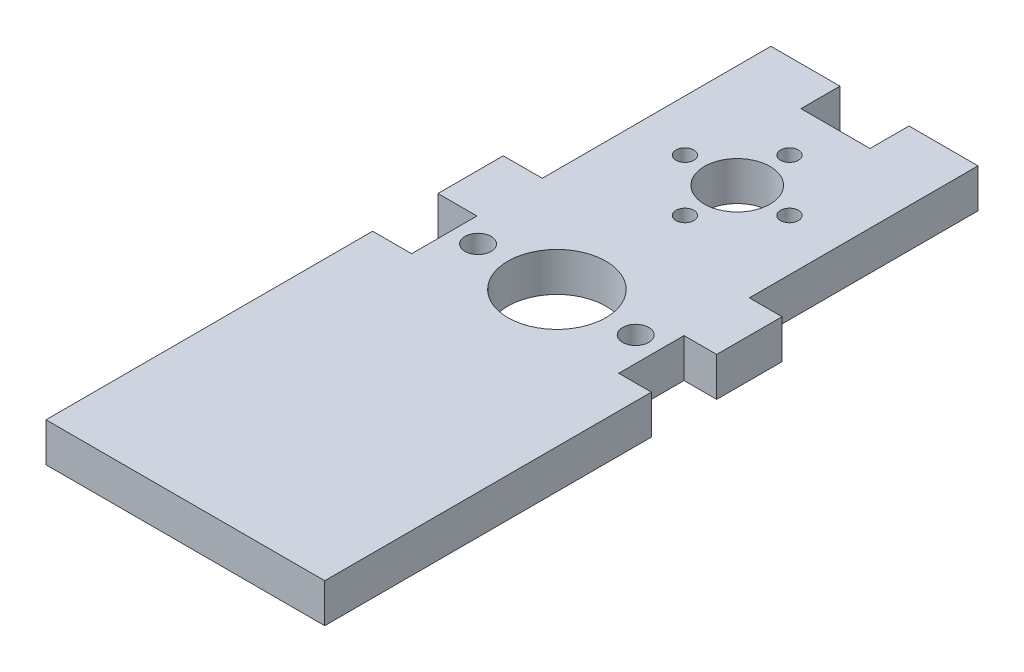
ISO-10303-21;
HEADER;
FILE_DESCRIPTION(('STEP AP214'),'2;1');
FILE_NAME('part.step','',(''),(''),'','','');
FILE_SCHEMA(('AUTOMOTIVE_DESIGN { 1 0 10303 214 1 1 1 1 }'));
ENDSEC;
DATA;
#1=APPLICATION_CONTEXT('core data for automotive mechanical design processes');
#2=APPLICATION_PROTOCOL_DEFINITION('international standard','automotive_design',2000,#1);
#3=PRODUCT_CONTEXT('',#1,'mechanical');
#4=PRODUCT('Part','Part','',(#3));
#5=PRODUCT_RELATED_PRODUCT_CATEGORY('part','',(#4));
#6=PRODUCT_DEFINITION_FORMATION('','',#4);
#7=PRODUCT_DEFINITION_CONTEXT('part definition',#1,'design');
#8=PRODUCT_DEFINITION('design','',#6,#7);
#9=PRODUCT_DEFINITION_SHAPE('','',#8);
#10=(LENGTH_UNIT() NAMED_UNIT(*) SI_UNIT(.MILLI.,.METRE.));
#11=(NAMED_UNIT(*) PLANE_ANGLE_UNIT() SI_UNIT($,.RADIAN.));
#12=(NAMED_UNIT(*) SI_UNIT($,.STERADIAN.) SOLID_ANGLE_UNIT());
#13=UNCERTAINTY_MEASURE_WITH_UNIT(LENGTH_MEASURE(1.E-05),#10,'distance_accuracy_value','');
#14=(GEOMETRIC_REPRESENTATION_CONTEXT(3) GLOBAL_UNCERTAINTY_ASSIGNED_CONTEXT((#13)) GLOBAL_UNIT_ASSIGNED_CONTEXT((#10,
#11,#12)) REPRESENTATION_CONTEXT('',''));
#15=CARTESIAN_POINT('',(0.,0.,0.));
#16=DIRECTION('',(0.,0.,1.));
#17=DIRECTION('',(1.,0.,0.));
#18=AXIS2_PLACEMENT_3D('',#15,#16,#17);
#19=CARTESIAN_POINT('',(31.7,5.969,0.));
#20=DIRECTION('',(-1.,0.,0.));
#21=DIRECTION('',(0.,0.,1.));
#22=AXIS2_PLACEMENT_3D('',#19,#20,#21);
#23=PLANE('',#22);
#24=DIRECTION('',(0.,1.,0.));
#25=VECTOR('',#24,1.);
#26=CARTESIAN_POINT('',(31.7,0.,-30.));
#27=LINE('',#26,#25);
#28=CARTESIAN_POINT('',(31.7,0.,-30.));
#29=VERTEX_POINT('',#28);
#30=CARTESIAN_POINT('',(31.7,5.969,-30.));
#31=VERTEX_POINT('',#30);
#32=EDGE_CURVE('E224',#29,#31,#27,.T.);
#33=ORIENTED_EDGE('',*,*,#32,.F.);
#34=DIRECTION('',(0.,0.,-1.));
#35=VECTOR('',#34,1.);
#36=CARTESIAN_POINT('',(31.7,0.,0.));
#37=LINE('',#36,#35);
#38=CARTESIAN_POINT('',(31.7,0.,-65.));
#39=VERTEX_POINT('',#38);
#40=EDGE_CURVE('E342',#29,#39,#37,.T.);
#41=ORIENTED_EDGE('',*,*,#40,.T.);
#42=DIRECTION('',(0.,-1.,0.));
#43=VECTOR('',#42,1.);
#44=CARTESIAN_POINT('',(31.7,5.969,-65.));
#45=LINE('',#44,#43);
#46=CARTESIAN_POINT('',(31.7,5.969,-65.));
#47=VERTEX_POINT('',#46);
#48=EDGE_CURVE('E11',#47,#39,#45,.T.);
#49=ORIENTED_EDGE('',*,*,#48,.F.);
#50=DIRECTION('',(0.,0.,-1.));
#51=VECTOR('',#50,1.);
#52=CARTESIAN_POINT('',(31.7,5.969,0.));
#53=LINE('',#52,#51);
#54=EDGE_CURVE('E325',#31,#47,#53,.T.);
#55=ORIENTED_EDGE('',*,*,#54,.F.);
#56=EDGE_LOOP('',(#33,#41,#49,#55));
#57=FACE_BOUND('',#56,.T.);
#58=ADVANCED_FACE('F32',(#57),#23,.F.);
#59=CARTESIAN_POINT('',(0.,5.969,0.));
#60=DIRECTION('',(1.,0.,0.));
#61=DIRECTION('',(0.,0.,-1.));
#62=AXIS2_PLACEMENT_3D('',#59,#60,#61);
#63=PLANE('',#62);
#64=DIRECTION('',(0.,0.,1.));
#65=VECTOR('',#64,1.);
#66=CARTESIAN_POINT('',(0.,5.969,0.));
#67=LINE('',#66,#65);
#68=CARTESIAN_POINT('',(0.,5.969,-20.));
#69=VERTEX_POINT('',#68);
#70=CARTESIAN_POINT('',(0.,5.969,-10.));
#71=VERTEX_POINT('',#70);
#72=EDGE_CURVE('E326',#69,#71,#67,.T.);
#73=ORIENTED_EDGE('',*,*,#72,.F.);
#74=DIRECTION('',(0.,1.,0.));
#75=VECTOR('',#74,1.);
#76=CARTESIAN_POINT('',(0.,0.,-20.));
#77=LINE('',#76,#75);
#78=CARTESIAN_POINT('',(0.,0.,-20.));
#79=VERTEX_POINT('',#78);
#80=EDGE_CURVE('E249',#79,#69,#77,.T.);
#81=ORIENTED_EDGE('',*,*,#80,.F.);
#82=DIRECTION('',(0.,0.,1.));
#83=VECTOR('',#82,1.);
#84=CARTESIAN_POINT('',(0.,0.,0.));
#85=LINE('',#84,#83);
#86=CARTESIAN_POINT('',(0.,0.,-10.));
#87=VERTEX_POINT('',#86);
#88=EDGE_CURVE('E319',#79,#87,#85,.T.);
#89=ORIENTED_EDGE('',*,*,#88,.T.);
#90=DIRECTION('',(0.,1.,0.));
#91=VECTOR('',#90,1.);
#92=CARTESIAN_POINT('',(0.,0.,-10.));
#93=LINE('',#92,#91);
#94=EDGE_CURVE('E265',#87,#71,#93,.T.);
#95=ORIENTED_EDGE('',*,*,#94,.T.);
#96=EDGE_LOOP('',(#73,#81,#89,#95));
#97=FACE_BOUND('',#96,.T.);
#98=ADVANCED_FACE('F424',(#97),#63,.F.);
#99=CARTESIAN_POINT('',(0.,5.969,0.));
#100=DIRECTION('',(0.,-1.,0.));
#101=DIRECTION('',(0.,0.,-1.));
#102=AXIS2_PLACEMENT_3D('',#99,#100,#101);
#103=PLANE('',#102);
#104=CARTESIAN_POINT('',(0.,5.969,-65.));
#105=VERTEX_POINT('',#104);
#106=CARTESIAN_POINT('',(0.,5.969,-30.));
#107=VERTEX_POINT('',#106);
#108=EDGE_CURVE('E322',#105,#107,#67,.T.);
#109=ORIENTED_EDGE('',*,*,#108,.T.);
#110=DIRECTION('',(-1.,0.,0.));
#111=VECTOR('',#110,1.);
#112=CARTESIAN_POINT('',(0.,5.969,-30.));
#113=LINE('',#112,#111);
#114=CARTESIAN_POINT('',(-5.969,5.969,-30.));
#115=VERTEX_POINT('',#114);
#116=EDGE_CURVE('E226',#107,#115,#113,.T.);
#117=ORIENTED_EDGE('',*,*,#116,.T.);
#118=DIRECTION('',(0.,0.,1.));
#119=VECTOR('',#118,1.);
#120=CARTESIAN_POINT('',(-5.969,5.969,-20.));
#121=LINE('',#120,#119);
#122=CARTESIAN_POINT('',(-5.969,5.969,-20.));
#123=VERTEX_POINT('',#122);
#124=EDGE_CURVE('E245',#115,#123,#121,.T.);
#125=ORIENTED_EDGE('',*,*,#124,.T.);
#126=DIRECTION('',(1.,0.,0.));
#127=VECTOR('',#126,1.);
#128=CARTESIAN_POINT('',(0.,5.969,-20.));
#129=LINE('',#128,#127);
#130=EDGE_CURVE('E237',#123,#69,#129,.T.);
#131=ORIENTED_EDGE('',*,*,#130,.T.);
#132=ORIENTED_EDGE('',*,*,#72,.T.);
#133=DIRECTION('',(-1.,0.,0.));
#134=VECTOR('',#133,1.);
#135=CARTESIAN_POINT('',(0.,5.969,-10.));
#136=LINE('',#135,#134);
#137=CARTESIAN_POINT('',(-5.969,5.969,-10.));
#138=VERTEX_POINT('',#137);
#139=EDGE_CURVE('E252',#71,#138,#136,.T.);
#140=ORIENTED_EDGE('',*,*,#139,.T.);
#141=DIRECTION('',(0.,0.,1.));
#142=VECTOR('',#141,1.);
#143=CARTESIAN_POINT('',(-5.969,5.969,0.));
#144=LINE('',#143,#142);
#145=CARTESIAN_POINT('',(-5.96899999999999,5.969,40.));
#146=VERTEX_POINT('',#145);
#147=EDGE_CURVE('E263',#138,#146,#144,.T.);
#148=ORIENTED_EDGE('',*,*,#147,.T.);
#149=DIRECTION('',(1.,0.,0.));
#150=VECTOR('',#149,1.);
#151=CARTESIAN_POINT('',(-5.96899999999999,5.969,40.));
#152=LINE('',#151,#150);
#153=CARTESIAN_POINT('',(36.7,5.969,40.));
#154=VERTEX_POINT('',#153);
#155=EDGE_CURVE('E195',#146,#154,#152,.T.);
#156=ORIENTED_EDGE('',*,*,#155,.T.);
#157=DIRECTION('',(0.,0.,-1.));
#158=VECTOR('',#157,1.);
#159=CARTESIAN_POINT('',(36.7,5.969,0.));
#160=LINE('',#159,#158);
#161=CARTESIAN_POINT('',(36.7,5.969,-10.));
#162=VERTEX_POINT('',#161);
#163=EDGE_CURVE('E187',#154,#162,#160,.T.);
#164=ORIENTED_EDGE('',*,*,#163,.T.);
#165=DIRECTION('',(-1.,0.,0.));
#166=VECTOR('',#165,1.);
#167=CARTESIAN_POINT('',(31.7,5.969,-10.));
#168=LINE('',#167,#166);
#169=CARTESIAN_POINT('',(31.7,5.969,-10.));
#170=VERTEX_POINT('',#169);
#171=EDGE_CURVE('E47',#162,#170,#168,.T.);
#172=ORIENTED_EDGE('',*,*,#171,.T.);
#173=CARTESIAN_POINT('',(31.7,5.969,-20.));
#174=VERTEX_POINT('',#173);
#175=EDGE_CURVE('E52',#170,#174,#53,.T.);
#176=ORIENTED_EDGE('',*,*,#175,.T.);
#177=DIRECTION('',(1.,0.,0.));
#178=VECTOR('',#177,1.);
#179=CARTESIAN_POINT('',(31.7,5.969,-20.));
#180=LINE('',#179,#178);
#181=CARTESIAN_POINT('',(36.7,5.969,-20.));
#182=VERTEX_POINT('',#181);
#183=EDGE_CURVE('E206',#174,#182,#180,.T.);
#184=ORIENTED_EDGE('',*,*,#183,.T.);
#185=DIRECTION('',(0.,0.,-1.));
#186=VECTOR('',#185,1.);
#187=CARTESIAN_POINT('',(36.7,5.969,-20.));
#188=LINE('',#187,#186);
#189=CARTESIAN_POINT('',(36.7,5.969,-30.));
#190=VERTEX_POINT('',#189);
#191=EDGE_CURVE('E219',#182,#190,#188,.T.);
#192=ORIENTED_EDGE('',*,*,#191,.T.);
#193=DIRECTION('',(-1.,0.,0.));
#194=VECTOR('',#193,1.);
#195=CARTESIAN_POINT('',(31.7,5.969,-30.));
#196=LINE('',#195,#194);
#197=EDGE_CURVE('E212',#190,#31,#196,.T.);
#198=ORIENTED_EDGE('',*,*,#197,.T.);
#199=ORIENTED_EDGE('',*,*,#54,.T.);
#200=DIRECTION('',(-1.,0.,0.));
#201=VECTOR('',#200,1.);
#202=CARTESIAN_POINT('',(21.1333333333333,5.969,-65.));
#203=LINE('',#202,#201);
#204=CARTESIAN_POINT('',(21.1333333333333,5.969,-65.));
#205=VERTEX_POINT('',#204);
#206=EDGE_CURVE('E328',#47,#205,#203,.T.);
#207=ORIENTED_EDGE('',*,*,#206,.T.);
#208=DIRECTION('',(0.,0.,1.));
#209=VECTOR('',#208,1.);
#210=CARTESIAN_POINT('',(21.1333333333333,5.969,-65.));
#211=LINE('',#210,#209);
#212=CARTESIAN_POINT('',(21.1333333333333,5.969,-59.031));
#213=VERTEX_POINT('',#212);
#214=EDGE_CURVE('E330',#205,#213,#211,.T.);
#215=ORIENTED_EDGE('',*,*,#214,.T.);
#216=DIRECTION('',(-1.,0.,0.));
#217=VECTOR('',#216,1.);
#218=CARTESIAN_POINT('',(21.1333333333333,5.969,-59.031));
#219=LINE('',#218,#217);
#220=CARTESIAN_POINT('',(10.5666666666667,5.969,-59.031));
#221=VERTEX_POINT('',#220);
#222=EDGE_CURVE('E332',#213,#221,#219,.T.);
#223=ORIENTED_EDGE('',*,*,#222,.T.);
#224=DIRECTION('',(0.,0.,-1.));
#225=VECTOR('',#224,1.);
#226=CARTESIAN_POINT('',(10.5666666666667,5.969,-65.));
#227=LINE('',#226,#225);
#228=CARTESIAN_POINT('',(10.5666666666667,5.969,-65.));
#229=VERTEX_POINT('',#228);
#230=EDGE_CURVE('E334',#221,#229,#227,.T.);
#231=ORIENTED_EDGE('',*,*,#230,.T.);
#232=DIRECTION('',(-1.,0.,0.));
#233=VECTOR('',#232,1.);
#234=CARTESIAN_POINT('',(0.,5.969,-65.));
#235=LINE('',#234,#233);
#236=EDGE_CURVE('E336',#229,#105,#235,.T.);
#237=ORIENTED_EDGE('',*,*,#236,.T.);
#238=EDGE_LOOP('',(#109,#117,#125,#131,#132,#140,#148,#156,#164,#172,#176,#184,#192,#198,#199,
#207,#215,#223,#231,#237));
#239=FACE_BOUND('',#238,.T.);
#240=CARTESIAN_POINT('',(15.85,5.969,-43.99));
#241=DIRECTION('',(0.,1.,0.));
#242=DIRECTION('',(0.,0.,1.));
#243=AXIS2_PLACEMENT_3D('',#240,#241,#242);
#244=CIRCLE('',#243,5.015);
#245=CARTESIAN_POINT('',(15.85,5.969,-38.975));
#246=VERTEX_POINT('',#245);
#247=EDGE_CURVE('E316',#246,#246,#244,.T.);
#248=ORIENTED_EDGE('',*,*,#247,.F.);
#249=EDGE_LOOP('',(#248));
#250=FACE_BOUND('',#249,.T.);
#251=CARTESIAN_POINT('',(15.85,5.969,-16.3861));
#252=DIRECTION('',(0.,1.,0.));
#253=DIRECTION('',(0.,0.,1.));
#254=AXIS2_PLACEMENT_3D('',#251,#252,#253);
#255=CIRCLE('',#254,7.5);
#256=CARTESIAN_POINT('',(15.85,5.969,-8.8861));
#257=VERTEX_POINT('',#256);
#258=EDGE_CURVE('E310',#257,#257,#255,.T.);
#259=ORIENTED_EDGE('',*,*,#258,.F.);
#260=EDGE_LOOP('',(#259));
#261=FACE_BOUND('',#260,.T.);
#262=CARTESIAN_POINT('',(3.785,5.969,-16.3861));
#263=DIRECTION('',(0.,1.,0.));
#264=DIRECTION('',(0.,0.,1.));
#265=AXIS2_PLACEMENT_3D('',#262,#263,#264);
#266=CIRCLE('',#265,2.);
#267=CARTESIAN_POINT('',(3.785,5.969,-14.3861));
#268=VERTEX_POINT('',#267);
#269=EDGE_CURVE('E304',#268,#268,#266,.T.);
#270=ORIENTED_EDGE('',*,*,#269,.F.);
#271=EDGE_LOOP('',(#270));
#272=FACE_BOUND('',#271,.T.);
#273=CARTESIAN_POINT('',(27.915,5.969,-16.3861));
#274=DIRECTION('',(0.,1.,0.));
#275=DIRECTION('',(0.,0.,1.));
#276=AXIS2_PLACEMENT_3D('',#273,#274,#275);
#277=CIRCLE('',#276,2.);
#278=CARTESIAN_POINT('',(27.915,5.969,-14.3861));
#279=VERTEX_POINT('',#278);
#280=EDGE_CURVE('E298',#279,#279,#277,.T.);
#281=ORIENTED_EDGE('',*,*,#280,.F.);
#282=EDGE_LOOP('',(#281));
#283=FACE_BOUND('',#282,.T.);
#284=CARTESIAN_POINT('',(7.85,5.969,-43.99));
#285=DIRECTION('',(0.,1.,0.));
#286=DIRECTION('',(0.,0.,1.));
#287=AXIS2_PLACEMENT_3D('',#284,#285,#286);
#288=CIRCLE('',#287,1.37);
#289=CARTESIAN_POINT('',(7.85,5.969,-42.62));
#290=VERTEX_POINT('',#289);
#291=EDGE_CURVE('E292',#290,#290,#288,.T.);
#292=ORIENTED_EDGE('',*,*,#291,.F.);
#293=EDGE_LOOP('',(#292));
#294=FACE_BOUND('',#293,.T.);
#295=CARTESIAN_POINT('',(23.85,5.969,-43.99));
#296=DIRECTION('',(0.,1.,0.));
#297=DIRECTION('',(0.,0.,1.));
#298=AXIS2_PLACEMENT_3D('',#295,#296,#297);
#299=CIRCLE('',#298,1.37);
#300=CARTESIAN_POINT('',(23.85,5.969,-42.62));
#301=VERTEX_POINT('',#300);
#302=EDGE_CURVE('E286',#301,#301,#299,.T.);
#303=ORIENTED_EDGE('',*,*,#302,.F.);
#304=EDGE_LOOP('',(#303));
#305=FACE_BOUND('',#304,.T.);
#306=CARTESIAN_POINT('',(15.85,5.969,-35.99));
#307=DIRECTION('',(0.,1.,0.));
#308=DIRECTION('',(0.,0.,1.));
#309=AXIS2_PLACEMENT_3D('',#306,#307,#308);
#310=CIRCLE('',#309,1.37);
#311=CARTESIAN_POINT('',(15.85,5.969,-34.62));
#312=VERTEX_POINT('',#311);
#313=EDGE_CURVE('E280',#312,#312,#310,.T.);
#314=ORIENTED_EDGE('',*,*,#313,.F.);
#315=EDGE_LOOP('',(#314));
#316=FACE_BOUND('',#315,.T.);
#317=CARTESIAN_POINT('',(15.85,5.969,-51.99));
#318=DIRECTION('',(0.,1.,0.));
#319=DIRECTION('',(0.,0.,1.));
#320=AXIS2_PLACEMENT_3D('',#317,#318,#319);
#321=CIRCLE('',#320,1.37);
#322=CARTESIAN_POINT('',(15.85,5.969,-50.62));
#323=VERTEX_POINT('',#322);
#324=EDGE_CURVE('E274',#323,#323,#321,.T.);
#325=ORIENTED_EDGE('',*,*,#324,.F.);
#326=EDGE_LOOP('',(#325));
#327=FACE_BOUND('',#326,.T.);
#328=ADVANCED_FACE('F388',(#239,#250,#261,#272,#283,#294,#305,#316,#327),#103,.F.);
#329=CARTESIAN_POINT('',(0.,0.,0.));
#330=DIRECTION('',(0.,-1.,0.));
#331=DIRECTION('',(0.,0.,-1.));
#332=AXIS2_PLACEMENT_3D('',#329,#330,#331);
#333=PLANE('',#332);
#334=CARTESIAN_POINT('',(15.85,0.,-35.99));
#335=DIRECTION('',(0.,1.,0.));
#336=DIRECTION('',(0.,0.,1.));
#337=AXIS2_PLACEMENT_3D('',#334,#335,#336);
#338=CIRCLE('',#337,1.37);
#339=CARTESIAN_POINT('',(15.85,0.,-34.62));
#340=VERTEX_POINT('',#339);
#341=EDGE_CURVE('E277',#340,#340,#338,.T.);
#342=ORIENTED_EDGE('',*,*,#341,.T.);
#343=EDGE_LOOP('',(#342));
#344=FACE_BOUND('',#343,.T.);
#345=CARTESIAN_POINT('',(7.85,0.,-43.99));
#346=DIRECTION('',(0.,1.,0.));
#347=DIRECTION('',(0.,0.,1.));
#348=AXIS2_PLACEMENT_3D('',#345,#346,#347);
#349=CIRCLE('',#348,1.37);
#350=CARTESIAN_POINT('',(7.85,0.,-42.62));
#351=VERTEX_POINT('',#350);
#352=EDGE_CURVE('E289',#351,#351,#349,.T.);
#353=ORIENTED_EDGE('',*,*,#352,.T.);
#354=EDGE_LOOP('',(#353));
#355=FACE_BOUND('',#354,.T.);
#356=CARTESIAN_POINT('',(3.785,0.,-16.3861));
#357=DIRECTION('',(0.,1.,0.));
#358=DIRECTION('',(0.,0.,1.));
#359=AXIS2_PLACEMENT_3D('',#356,#357,#358);
#360=CIRCLE('',#359,2.);
#361=CARTESIAN_POINT('',(3.785,0.,-14.3861));
#362=VERTEX_POINT('',#361);
#363=EDGE_CURVE('E301',#362,#362,#360,.T.);
#364=ORIENTED_EDGE('',*,*,#363,.T.);
#365=EDGE_LOOP('',(#364));
#366=FACE_BOUND('',#365,.T.);
#367=CARTESIAN_POINT('',(15.85,0.,-43.99));
#368=DIRECTION('',(0.,1.,0.));
#369=DIRECTION('',(0.,0.,1.));
#370=AXIS2_PLACEMENT_3D('',#367,#368,#369);
#371=CIRCLE('',#370,5.015);
#372=CARTESIAN_POINT('',(15.85,0.,-38.975));
#373=VERTEX_POINT('',#372);
#374=EDGE_CURVE('E313',#373,#373,#371,.T.);
#375=ORIENTED_EDGE('',*,*,#374,.T.);
#376=EDGE_LOOP('',(#375));
#377=FACE_BOUND('',#376,.T.);
#378=CARTESIAN_POINT('',(0.,0.,-65.));
#379=VERTEX_POINT('',#378);
#380=CARTESIAN_POINT('',(0.,0.,-30.));
#381=VERTEX_POINT('',#380);
#382=EDGE_CURVE('E339',#379,#381,#85,.T.);
#383=ORIENTED_EDGE('',*,*,#382,.F.);
#384=DIRECTION('',(-1.,0.,0.));
#385=VECTOR('',#384,1.);
#386=CARTESIAN_POINT('',(0.,0.,-65.));
#387=LINE('',#386,#385);
#388=CARTESIAN_POINT('',(10.5666666666667,0.,-65.));
#389=VERTEX_POINT('',#388);
#390=EDGE_CURVE('E353',#389,#379,#387,.T.);
#391=ORIENTED_EDGE('',*,*,#390,.F.);
#392=DIRECTION('',(0.,0.,-1.));
#393=VECTOR('',#392,1.);
#394=CARTESIAN_POINT('',(10.5666666666667,0.,-65.));
#395=LINE('',#394,#393);
#396=CARTESIAN_POINT('',(10.5666666666667,0.,-59.031));
#397=VERTEX_POINT('',#396);
#398=EDGE_CURVE('E351',#397,#389,#395,.T.);
#399=ORIENTED_EDGE('',*,*,#398,.F.);
#400=DIRECTION('',(-1.,0.,0.));
#401=VECTOR('',#400,1.);
#402=CARTESIAN_POINT('',(21.1333333333333,0.,-59.031));
#403=LINE('',#402,#401);
#404=CARTESIAN_POINT('',(21.1333333333333,0.,-59.031));
#405=VERTEX_POINT('',#404);
#406=EDGE_CURVE('E349',#405,#397,#403,.T.);
#407=ORIENTED_EDGE('',*,*,#406,.F.);
#408=DIRECTION('',(0.,0.,1.));
#409=VECTOR('',#408,1.);
#410=CARTESIAN_POINT('',(21.1333333333333,0.,-65.));
#411=LINE('',#410,#409);
#412=CARTESIAN_POINT('',(21.1333333333333,0.,-65.));
#413=VERTEX_POINT('',#412);
#414=EDGE_CURVE('E347',#413,#405,#411,.T.);
#415=ORIENTED_EDGE('',*,*,#414,.F.);
#416=DIRECTION('',(-1.,0.,0.));
#417=VECTOR('',#416,1.);
#418=CARTESIAN_POINT('',(21.1333333333333,0.,-65.));
#419=LINE('',#418,#417);
#420=EDGE_CURVE('E345',#39,#413,#419,.T.);
#421=ORIENTED_EDGE('',*,*,#420,.F.);
#422=ORIENTED_EDGE('',*,*,#40,.F.);
#423=DIRECTION('',(-1.,0.,0.));
#424=VECTOR('',#423,1.);
#425=CARTESIAN_POINT('',(31.7,0.,-30.));
#426=LINE('',#425,#424);
#427=CARTESIAN_POINT('',(36.7,0.,-30.));
#428=VERTEX_POINT('',#427);
#429=EDGE_CURVE('E215',#428,#29,#426,.T.);
#430=ORIENTED_EDGE('',*,*,#429,.F.);
#431=DIRECTION('',(0.,0.,-1.));
#432=VECTOR('',#431,1.);
#433=CARTESIAN_POINT('',(36.7,0.,-20.));
#434=LINE('',#433,#432);
#435=CARTESIAN_POINT('',(36.7,0.,-20.));
#436=VERTEX_POINT('',#435);
#437=EDGE_CURVE('E211',#436,#428,#434,.T.);
#438=ORIENTED_EDGE('',*,*,#437,.F.);
#439=DIRECTION('',(1.,0.,0.));
#440=VECTOR('',#439,1.);
#441=CARTESIAN_POINT('',(31.7,0.,-20.));
#442=LINE('',#441,#440);
#443=CARTESIAN_POINT('',(31.7,0.,-20.));
#444=VERTEX_POINT('',#443);
#445=EDGE_CURVE('E208',#444,#436,#442,.T.);
#446=ORIENTED_EDGE('',*,*,#445,.F.);
#447=CARTESIAN_POINT('',(31.7,0.,-10.));
#448=VERTEX_POINT('',#447);
#449=EDGE_CURVE('E343',#448,#444,#37,.T.);
#450=ORIENTED_EDGE('',*,*,#449,.F.);
#451=DIRECTION('',(-1.,0.,0.));
#452=VECTOR('',#451,1.);
#453=CARTESIAN_POINT('',(31.7,0.,-10.));
#454=LINE('',#453,#452);
#455=CARTESIAN_POINT('',(36.7,0.,-10.));
#456=VERTEX_POINT('',#455);
#457=EDGE_CURVE('E181',#456,#448,#454,.T.);
#458=ORIENTED_EDGE('',*,*,#457,.F.);
#459=DIRECTION('',(0.,0.,-1.));
#460=VECTOR('',#459,1.);
#461=CARTESIAN_POINT('',(36.7,0.,0.));
#462=LINE('',#461,#460);
#463=CARTESIAN_POINT('',(36.7,0.,40.));
#464=VERTEX_POINT('',#463);
#465=EDGE_CURVE('E171',#464,#456,#462,.T.);
#466=ORIENTED_EDGE('',*,*,#465,.F.);
#467=DIRECTION('',(1.,0.,0.));
#468=VECTOR('',#467,1.);
#469=CARTESIAN_POINT('',(-5.96899999999999,0.,40.));
#470=LINE('',#469,#468);
#471=CARTESIAN_POINT('',(-5.96899999999999,0.,40.));
#472=VERTEX_POINT('',#471);
#473=EDGE_CURVE('E178',#472,#464,#470,.T.);
#474=ORIENTED_EDGE('',*,*,#473,.F.);
#475=DIRECTION('',(0.,0.,1.));
#476=VECTOR('',#475,1.);
#477=CARTESIAN_POINT('',(-5.969,0.,0.));
#478=LINE('',#477,#476);
#479=CARTESIAN_POINT('',(-5.969,0.,-10.));
#480=VERTEX_POINT('',#479);
#481=EDGE_CURVE('E262',#480,#472,#478,.T.);
#482=ORIENTED_EDGE('',*,*,#481,.F.);
#483=DIRECTION('',(-1.,0.,0.));
#484=VECTOR('',#483,1.);
#485=CARTESIAN_POINT('',(0.,0.,-10.));
#486=LINE('',#485,#484);
#487=EDGE_CURVE('E259',#87,#480,#486,.T.);
#488=ORIENTED_EDGE('',*,*,#487,.F.);
#489=ORIENTED_EDGE('',*,*,#88,.F.);
#490=DIRECTION('',(1.,0.,0.));
#491=VECTOR('',#490,1.);
#492=CARTESIAN_POINT('',(0.,0.,-20.));
#493=LINE('',#492,#491);
#494=CARTESIAN_POINT('',(-5.969,0.,-20.));
#495=VERTEX_POINT('',#494);
#496=EDGE_CURVE('E240',#495,#79,#493,.T.);
#497=ORIENTED_EDGE('',*,*,#496,.F.);
#498=DIRECTION('',(0.,0.,1.));
#499=VECTOR('',#498,1.);
#500=CARTESIAN_POINT('',(-5.969,0.,-20.));
#501=LINE('',#500,#499);
#502=CARTESIAN_POINT('',(-5.969,0.,-30.));
#503=VERTEX_POINT('',#502);
#504=EDGE_CURVE('E236',#503,#495,#501,.T.);
#505=ORIENTED_EDGE('',*,*,#504,.F.);
#506=DIRECTION('',(-1.,0.,0.));
#507=VECTOR('',#506,1.);
#508=CARTESIAN_POINT('',(0.,0.,-30.));
#509=LINE('',#508,#507);
#510=EDGE_CURVE('E233',#381,#503,#509,.T.);
#511=ORIENTED_EDGE('',*,*,#510,.F.);
#512=EDGE_LOOP('',(#383,#391,#399,#407,#415,#421,#422,#430,#438,#446,#450,#458,#466,#474,#482,
#488,#489,#497,#505,#511));
#513=FACE_BOUND('',#512,.T.);
#514=CARTESIAN_POINT('',(15.85,0.,-16.3861));
#515=DIRECTION('',(0.,1.,0.));
#516=DIRECTION('',(0.,0.,1.));
#517=AXIS2_PLACEMENT_3D('',#514,#515,#516);
#518=CIRCLE('',#517,7.5);
#519=CARTESIAN_POINT('',(15.85,0.,-8.8861));
#520=VERTEX_POINT('',#519);
#521=EDGE_CURVE('E307',#520,#520,#518,.T.);
#522=ORIENTED_EDGE('',*,*,#521,.T.);
#523=EDGE_LOOP('',(#522));
#524=FACE_BOUND('',#523,.T.);
#525=CARTESIAN_POINT('',(27.915,0.,-16.3861));
#526=DIRECTION('',(0.,1.,0.));
#527=DIRECTION('',(0.,0.,1.));
#528=AXIS2_PLACEMENT_3D('',#525,#526,#527);
#529=CIRCLE('',#528,2.);
#530=CARTESIAN_POINT('',(27.915,0.,-14.3861));
#531=VERTEX_POINT('',#530);
#532=EDGE_CURVE('E295',#531,#531,#529,.T.);
#533=ORIENTED_EDGE('',*,*,#532,.T.);
#534=EDGE_LOOP('',(#533));
#535=FACE_BOUND('',#534,.T.);
#536=CARTESIAN_POINT('',(23.85,0.,-43.99));
#537=DIRECTION('',(0.,1.,0.));
#538=DIRECTION('',(0.,0.,1.));
#539=AXIS2_PLACEMENT_3D('',#536,#537,#538);
#540=CIRCLE('',#539,1.37);
#541=CARTESIAN_POINT('',(23.85,0.,-42.62));
#542=VERTEX_POINT('',#541);
#543=EDGE_CURVE('E283',#542,#542,#540,.T.);
#544=ORIENTED_EDGE('',*,*,#543,.T.);
#545=EDGE_LOOP('',(#544));
#546=FACE_BOUND('',#545,.T.);
#547=CARTESIAN_POINT('',(15.85,0.,-51.99));
#548=DIRECTION('',(0.,1.,0.));
#549=DIRECTION('',(0.,0.,1.));
#550=AXIS2_PLACEMENT_3D('',#547,#548,#549);
#551=CIRCLE('',#550,1.37);
#552=CARTESIAN_POINT('',(15.85,0.,-50.62));
#553=VERTEX_POINT('',#552);
#554=EDGE_CURVE('E271',#553,#553,#551,.T.);
#555=ORIENTED_EDGE('',*,*,#554,.T.);
#556=EDGE_LOOP('',(#555));
#557=FACE_BOUND('',#556,.T.);
#558=ADVANCED_FACE('F174',(#344,#355,#366,#377,#513,#524,#535,#546,#557),#333,.T.);
#559=ORIENTED_EDGE('',*,*,#382,.T.);
#560=DIRECTION('',(0.,1.,0.));
#561=VECTOR('',#560,1.);
#562=CARTESIAN_POINT('',(0.,0.,-30.));
#563=LINE('',#562,#561);
#564=EDGE_CURVE('E242',#381,#107,#563,.T.);
#565=ORIENTED_EDGE('',*,*,#564,.T.);
#566=ORIENTED_EDGE('',*,*,#108,.F.);
#567=DIRECTION('',(0.,-1.,0.));
#568=VECTOR('',#567,1.);
#569=CARTESIAN_POINT('',(0.,5.969,-65.));
#570=LINE('',#569,#568);
#571=EDGE_CURVE('E338',#105,#379,#570,.T.);
#572=ORIENTED_EDGE('',*,*,#571,.T.);
#573=EDGE_LOOP('',(#559,#565,#566,#572));
#574=FACE_BOUND('',#573,.T.);
#575=ADVANCED_FACE('F34',(#574),#63,.F.);
#576=ORIENTED_EDGE('',*,*,#175,.F.);
#577=DIRECTION('',(0.,1.,0.));
#578=VECTOR('',#577,1.);
#579=CARTESIAN_POINT('',(31.7,0.,-10.));
#580=LINE('',#579,#578);
#581=EDGE_CURVE('E204',#448,#170,#580,.T.);
#582=ORIENTED_EDGE('',*,*,#581,.F.);
#583=ORIENTED_EDGE('',*,*,#449,.T.);
#584=DIRECTION('',(0.,1.,0.));
#585=VECTOR('',#584,1.);
#586=CARTESIAN_POINT('',(31.7,0.,-20.));
#587=LINE('',#586,#585);
#588=EDGE_CURVE('E217',#444,#174,#587,.T.);
#589=ORIENTED_EDGE('',*,*,#588,.T.);
#590=EDGE_LOOP('',(#576,#582,#583,#589));
#591=FACE_BOUND('',#590,.T.);
#592=ADVANCED_FACE('F410',(#591),#23,.F.);
#593=CARTESIAN_POINT('',(21.1333333333333,5.969,-65.));
#594=DIRECTION('',(0.,0.,1.));
#595=DIRECTION('',(1.,0.,0.));
#596=AXIS2_PLACEMENT_3D('',#593,#594,#595);
#597=PLANE('',#596);
#598=ORIENTED_EDGE('',*,*,#420,.T.);
#599=DIRECTION('',(0.,-1.,0.));
#600=VECTOR('',#599,1.);
#601=CARTESIAN_POINT('',(21.1333333333333,5.969,-65.));
#602=LINE('',#601,#600);
#603=EDGE_CURVE('E40',#205,#413,#602,.T.);
#604=ORIENTED_EDGE('',*,*,#603,.F.);
#605=ORIENTED_EDGE('',*,*,#206,.F.);
#606=ORIENTED_EDGE('',*,*,#48,.T.);
#607=EDGE_LOOP('',(#598,#604,#605,#606));
#608=FACE_BOUND('',#607,.T.);
#609=ADVANCED_FACE('F393',(#608),#597,.F.);
#610=CARTESIAN_POINT('',(21.1333333333333,5.969,-65.));
#611=DIRECTION('',(1.,0.,0.));
#612=DIRECTION('',(0.,0.,-1.));
#613=AXIS2_PLACEMENT_3D('',#610,#611,#612);
#614=PLANE('',#613);
#615=ORIENTED_EDGE('',*,*,#414,.T.);
#616=DIRECTION('',(0.,-1.,0.));
#617=VECTOR('',#616,1.);
#618=CARTESIAN_POINT('',(21.1333333333333,5.969,-59.031));
#619=LINE('',#618,#617);
#620=EDGE_CURVE('E363',#213,#405,#619,.T.);
#621=ORIENTED_EDGE('',*,*,#620,.F.);
#622=ORIENTED_EDGE('',*,*,#214,.F.);
#623=ORIENTED_EDGE('',*,*,#603,.T.);
#624=EDGE_LOOP('',(#615,#621,#622,#623));
#625=FACE_BOUND('',#624,.T.);
#626=ADVANCED_FACE('F370',(#625),#614,.F.);
#627=CARTESIAN_POINT('',(21.1333333333333,5.969,-59.031));
#628=DIRECTION('',(0.,0.,1.));
#629=DIRECTION('',(1.,0.,0.));
#630=AXIS2_PLACEMENT_3D('',#627,#628,#629);
#631=PLANE('',#630);
#632=ORIENTED_EDGE('',*,*,#406,.T.);
#633=DIRECTION('',(0.,-1.,0.));
#634=VECTOR('',#633,1.);
#635=CARTESIAN_POINT('',(10.5666666666667,5.969,-59.031));
#636=LINE('',#635,#634);
#637=EDGE_CURVE('E360',#221,#397,#636,.T.);
#638=ORIENTED_EDGE('',*,*,#637,.F.);
#639=ORIENTED_EDGE('',*,*,#222,.F.);
#640=ORIENTED_EDGE('',*,*,#620,.T.);
#641=EDGE_LOOP('',(#632,#638,#639,#640));
#642=FACE_BOUND('',#641,.T.);
#643=ADVANCED_FACE('F381',(#642),#631,.F.);
#644=CARTESIAN_POINT('',(10.5666666666667,5.969,-65.));
#645=DIRECTION('',(-1.,0.,0.));
#646=DIRECTION('',(0.,0.,1.));
#647=AXIS2_PLACEMENT_3D('',#644,#645,#646);
#648=PLANE('',#647);
#649=ORIENTED_EDGE('',*,*,#398,.T.);
#650=DIRECTION('',(0.,-1.,0.));
#651=VECTOR('',#650,1.);
#652=CARTESIAN_POINT('',(10.5666666666667,5.969,-65.));
#653=LINE('',#652,#651);
#654=EDGE_CURVE('E357',#229,#389,#653,.T.);
#655=ORIENTED_EDGE('',*,*,#654,.F.);
#656=ORIENTED_EDGE('',*,*,#230,.F.);
#657=ORIENTED_EDGE('',*,*,#637,.T.);
#658=EDGE_LOOP('',(#649,#655,#656,#657));
#659=FACE_BOUND('',#658,.T.);
#660=ADVANCED_FACE('F385',(#659),#648,.F.);
#661=CARTESIAN_POINT('',(0.,5.969,-65.));
#662=DIRECTION('',(0.,0.,1.));
#663=DIRECTION('',(1.,0.,0.));
#664=AXIS2_PLACEMENT_3D('',#661,#662,#663);
#665=PLANE('',#664);
#666=ORIENTED_EDGE('',*,*,#390,.T.);
#667=ORIENTED_EDGE('',*,*,#571,.F.);
#668=ORIENTED_EDGE('',*,*,#236,.F.);
#669=ORIENTED_EDGE('',*,*,#654,.T.);
#670=EDGE_LOOP('',(#666,#667,#668,#669));
#671=FACE_BOUND('',#670,.T.);
#672=ADVANCED_FACE('F440',(#671),#665,.F.);
#673=CARTESIAN_POINT('',(15.85,5.969,-43.99));
#674=DIRECTION('',(0.,-1.,0.));
#675=DIRECTION('',(0.,0.,-1.));
#676=AXIS2_PLACEMENT_3D('',#673,#674,#675);
#677=CYLINDRICAL_SURFACE('',#676,5.015);
#678=ORIENTED_EDGE('',*,*,#247,.T.);
#679=EDGE_LOOP('',(#678));
#680=FACE_BOUND('',#679,.T.);
#681=ORIENTED_EDGE('',*,*,#374,.F.);
#682=EDGE_LOOP('',(#681));
#683=FACE_BOUND('',#682,.T.);
#684=ADVANCED_FACE('F442',(#680,#683),#677,.F.);
#685=CARTESIAN_POINT('',(15.85,5.969,-16.3861));
#686=DIRECTION('',(0.,-1.,0.));
#687=DIRECTION('',(0.,0.,-1.));
#688=AXIS2_PLACEMENT_3D('',#685,#686,#687);
#689=CYLINDRICAL_SURFACE('',#688,7.5);
#690=ORIENTED_EDGE('',*,*,#258,.T.);
#691=EDGE_LOOP('',(#690));
#692=FACE_BOUND('',#691,.T.);
#693=ORIENTED_EDGE('',*,*,#521,.F.);
#694=EDGE_LOOP('',(#693));
#695=FACE_BOUND('',#694,.T.);
#696=ADVANCED_FACE('F448',(#692,#695),#689,.F.);
#697=CARTESIAN_POINT('',(3.785,5.969,-16.3861));
#698=DIRECTION('',(0.,-1.,0.));
#699=DIRECTION('',(0.,0.,-1.));
#700=AXIS2_PLACEMENT_3D('',#697,#698,#699);
#701=CYLINDRICAL_SURFACE('',#700,2.);
#702=ORIENTED_EDGE('',*,*,#269,.T.);
#703=EDGE_LOOP('',(#702));
#704=FACE_BOUND('',#703,.T.);
#705=ORIENTED_EDGE('',*,*,#363,.F.);
#706=EDGE_LOOP('',(#705));
#707=FACE_BOUND('',#706,.T.);
#708=ADVANCED_FACE('F475',(#704,#707),#701,.F.);
#709=CARTESIAN_POINT('',(27.915,5.969,-16.3861));
#710=DIRECTION('',(0.,-1.,0.));
#711=DIRECTION('',(0.,0.,-1.));
#712=AXIS2_PLACEMENT_3D('',#709,#710,#711);
#713=CYLINDRICAL_SURFACE('',#712,2.);
#714=ORIENTED_EDGE('',*,*,#280,.T.);
#715=EDGE_LOOP('',(#714));
#716=FACE_BOUND('',#715,.T.);
#717=ORIENTED_EDGE('',*,*,#532,.F.);
#718=EDGE_LOOP('',(#717));
#719=FACE_BOUND('',#718,.T.);
#720=ADVANCED_FACE('F479',(#716,#719),#713,.F.);
#721=CARTESIAN_POINT('',(7.85,5.969,-43.99));
#722=DIRECTION('',(0.,-1.,0.));
#723=DIRECTION('',(0.,0.,-1.));
#724=AXIS2_PLACEMENT_3D('',#721,#722,#723);
#725=CYLINDRICAL_SURFACE('',#724,1.37);
#726=ORIENTED_EDGE('',*,*,#291,.T.);
#727=EDGE_LOOP('',(#726));
#728=FACE_BOUND('',#727,.T.);
#729=ORIENTED_EDGE('',*,*,#352,.F.);
#730=EDGE_LOOP('',(#729));
#731=FACE_BOUND('',#730,.T.);
#732=ADVANCED_FACE('F483',(#728,#731),#725,.F.);
#733=CARTESIAN_POINT('',(23.85,5.969,-43.99));
#734=DIRECTION('',(0.,-1.,0.));
#735=DIRECTION('',(0.,0.,-1.));
#736=AXIS2_PLACEMENT_3D('',#733,#734,#735);
#737=CYLINDRICAL_SURFACE('',#736,1.37);
#738=ORIENTED_EDGE('',*,*,#302,.T.);
#739=EDGE_LOOP('',(#738));
#740=FACE_BOUND('',#739,.T.);
#741=ORIENTED_EDGE('',*,*,#543,.F.);
#742=EDGE_LOOP('',(#741));
#743=FACE_BOUND('',#742,.T.);
#744=ADVANCED_FACE('F487',(#740,#743),#737,.F.);
#745=CARTESIAN_POINT('',(15.85,5.969,-35.99));
#746=DIRECTION('',(0.,-1.,0.));
#747=DIRECTION('',(0.,0.,-1.));
#748=AXIS2_PLACEMENT_3D('',#745,#746,#747);
#749=CYLINDRICAL_SURFACE('',#748,1.37);
#750=ORIENTED_EDGE('',*,*,#313,.T.);
#751=EDGE_LOOP('',(#750));
#752=FACE_BOUND('',#751,.T.);
#753=ORIENTED_EDGE('',*,*,#341,.F.);
#754=EDGE_LOOP('',(#753));
#755=FACE_BOUND('',#754,.T.);
#756=ADVANCED_FACE('F491',(#752,#755),#749,.F.);
#757=CARTESIAN_POINT('',(15.85,5.969,-51.99));
#758=DIRECTION('',(0.,-1.,0.));
#759=DIRECTION('',(0.,0.,-1.));
#760=AXIS2_PLACEMENT_3D('',#757,#758,#759);
#761=CYLINDRICAL_SURFACE('',#760,1.37);
#762=ORIENTED_EDGE('',*,*,#324,.T.);
#763=EDGE_LOOP('',(#762));
#764=FACE_BOUND('',#763,.T.);
#765=ORIENTED_EDGE('',*,*,#554,.F.);
#766=EDGE_LOOP('',(#765));
#767=FACE_BOUND('',#766,.T.);
#768=ADVANCED_FACE('F495',(#764,#767),#761,.F.);
#769=CARTESIAN_POINT('',(-5.969,0.,0.));
#770=DIRECTION('',(-1.,0.,0.));
#771=DIRECTION('',(0.,0.,1.));
#772=AXIS2_PLACEMENT_3D('',#769,#770,#771);
#773=PLANE('',#772);
#774=ORIENTED_EDGE('',*,*,#147,.F.);
#775=DIRECTION('',(0.,1.,0.));
#776=VECTOR('',#775,1.);
#777=CARTESIAN_POINT('',(-5.969,0.,-10.));
#778=LINE('',#777,#776);
#779=EDGE_CURVE('E269',#480,#138,#778,.T.);
#780=ORIENTED_EDGE('',*,*,#779,.F.);
#781=ORIENTED_EDGE('',*,*,#481,.T.);
#782=DIRECTION('',(0.,1.,0.));
#783=VECTOR('',#782,1.);
#784=CARTESIAN_POINT('',(-5.96899999999999,-58.4862681404789,40.));
#785=LINE('',#784,#783);
#786=EDGE_CURVE('E191',#472,#146,#785,.T.);
#787=ORIENTED_EDGE('',*,*,#786,.T.);
#788=EDGE_LOOP('',(#774,#780,#781,#787));
#789=FACE_BOUND('',#788,.T.);
#790=ADVANCED_FACE('F416',(#789),#773,.T.);
#791=CARTESIAN_POINT('',(0.,0.,-10.));
#792=DIRECTION('',(0.,0.,-1.));
#793=DIRECTION('',(-1.,0.,0.));
#794=AXIS2_PLACEMENT_3D('',#791,#792,#793);
#795=PLANE('',#794);
#796=ORIENTED_EDGE('',*,*,#139,.F.);
#797=ORIENTED_EDGE('',*,*,#94,.F.);
#798=ORIENTED_EDGE('',*,*,#487,.T.);
#799=ORIENTED_EDGE('',*,*,#779,.T.);
#800=EDGE_LOOP('',(#796,#797,#798,#799));
#801=FACE_BOUND('',#800,.T.);
#802=ADVANCED_FACE('F421',(#801),#795,.T.);
#803=CARTESIAN_POINT('',(0.,0.,-20.));
#804=DIRECTION('',(0.,0.,1.));
#805=DIRECTION('',(1.,0.,0.));
#806=AXIS2_PLACEMENT_3D('',#803,#804,#805);
#807=PLANE('',#806);
#808=ORIENTED_EDGE('',*,*,#130,.F.);
#809=DIRECTION('',(0.,1.,0.));
#810=VECTOR('',#809,1.);
#811=CARTESIAN_POINT('',(-5.969,0.,-20.));
#812=LINE('',#811,#810);
#813=EDGE_CURVE('E253',#495,#123,#812,.T.);
#814=ORIENTED_EDGE('',*,*,#813,.F.);
#815=ORIENTED_EDGE('',*,*,#496,.T.);
#816=ORIENTED_EDGE('',*,*,#80,.T.);
#817=EDGE_LOOP('',(#808,#814,#815,#816));
#818=FACE_BOUND('',#817,.T.);
#819=ADVANCED_FACE('F431',(#818),#807,.T.);
#820=CARTESIAN_POINT('',(-5.969,0.,-20.));
#821=DIRECTION('',(-1.,0.,0.));
#822=DIRECTION('',(0.,0.,1.));
#823=AXIS2_PLACEMENT_3D('',#820,#821,#822);
#824=PLANE('',#823);
#825=ORIENTED_EDGE('',*,*,#124,.F.);
#826=DIRECTION('',(0.,1.,0.));
#827=VECTOR('',#826,1.);
#828=CARTESIAN_POINT('',(-5.969,0.,-30.));
#829=LINE('',#828,#827);
#830=EDGE_CURVE('E255',#503,#115,#829,.T.);
#831=ORIENTED_EDGE('',*,*,#830,.F.);
#832=ORIENTED_EDGE('',*,*,#504,.T.);
#833=ORIENTED_EDGE('',*,*,#813,.T.);
#834=EDGE_LOOP('',(#825,#831,#832,#833));
#835=FACE_BOUND('',#834,.T.);
#836=ADVANCED_FACE('F434',(#835),#824,.T.);
#837=CARTESIAN_POINT('',(0.,0.,-30.));
#838=DIRECTION('',(0.,0.,-1.));
#839=DIRECTION('',(-1.,0.,0.));
#840=AXIS2_PLACEMENT_3D('',#837,#838,#839);
#841=PLANE('',#840);
#842=ORIENTED_EDGE('',*,*,#116,.F.);
#843=ORIENTED_EDGE('',*,*,#564,.F.);
#844=ORIENTED_EDGE('',*,*,#510,.T.);
#845=ORIENTED_EDGE('',*,*,#830,.T.);
#846=EDGE_LOOP('',(#842,#843,#844,#845));
#847=FACE_BOUND('',#846,.T.);
#848=ADVANCED_FACE('F436',(#847),#841,.T.);
#849=CARTESIAN_POINT('',(31.7,0.,-30.));
#850=DIRECTION('',(0.,0.,-1.));
#851=DIRECTION('',(-1.,0.,0.));
#852=AXIS2_PLACEMENT_3D('',#849,#850,#851);
#853=PLANE('',#852);
#854=ORIENTED_EDGE('',*,*,#197,.F.);
#855=DIRECTION('',(0.,1.,0.));
#856=VECTOR('',#855,1.);
#857=CARTESIAN_POINT('',(36.7,0.,-30.));
#858=LINE('',#857,#856);
#859=EDGE_CURVE('E227',#428,#190,#858,.T.);
#860=ORIENTED_EDGE('',*,*,#859,.F.);
#861=ORIENTED_EDGE('',*,*,#429,.T.);
#862=ORIENTED_EDGE('',*,*,#32,.T.);
#863=EDGE_LOOP('',(#854,#860,#861,#862));
#864=FACE_BOUND('',#863,.T.);
#865=ADVANCED_FACE('F401',(#864),#853,.T.);
#866=CARTESIAN_POINT('',(36.7,0.,-20.));
#867=DIRECTION('',(1.,0.,0.));
#868=DIRECTION('',(0.,0.,-1.));
#869=AXIS2_PLACEMENT_3D('',#866,#867,#868);
#870=PLANE('',#869);
#871=ORIENTED_EDGE('',*,*,#191,.F.);
#872=DIRECTION('',(0.,1.,0.));
#873=VECTOR('',#872,1.);
#874=CARTESIAN_POINT('',(36.7,0.,-20.));
#875=LINE('',#874,#873);
#876=EDGE_CURVE('E229',#436,#182,#875,.T.);
#877=ORIENTED_EDGE('',*,*,#876,.F.);
#878=ORIENTED_EDGE('',*,*,#437,.T.);
#879=ORIENTED_EDGE('',*,*,#859,.T.);
#880=EDGE_LOOP('',(#871,#877,#878,#879));
#881=FACE_BOUND('',#880,.T.);
#882=ADVANCED_FACE('F404',(#881),#870,.T.);
#883=CARTESIAN_POINT('',(31.7,0.,-20.));
#884=DIRECTION('',(0.,0.,1.));
#885=DIRECTION('',(1.,0.,0.));
#886=AXIS2_PLACEMENT_3D('',#883,#884,#885);
#887=PLANE('',#886);
#888=ORIENTED_EDGE('',*,*,#183,.F.);
#889=ORIENTED_EDGE('',*,*,#588,.F.);
#890=ORIENTED_EDGE('',*,*,#445,.T.);
#891=ORIENTED_EDGE('',*,*,#876,.T.);
#892=EDGE_LOOP('',(#888,#889,#890,#891));
#893=FACE_BOUND('',#892,.T.);
#894=ADVANCED_FACE('F406',(#893),#887,.T.);
#895=CARTESIAN_POINT('',(31.7,0.,-10.));
#896=DIRECTION('',(0.,0.,-1.));
#897=DIRECTION('',(-1.,0.,0.));
#898=AXIS2_PLACEMENT_3D('',#895,#896,#897);
#899=PLANE('',#898);
#900=ORIENTED_EDGE('',*,*,#171,.F.);
#901=DIRECTION('',(0.,1.,0.));
#902=VECTOR('',#901,1.);
#903=CARTESIAN_POINT('',(36.7,0.,-10.));
#904=LINE('',#903,#902);
#905=EDGE_CURVE('E201',#456,#162,#904,.T.);
#906=ORIENTED_EDGE('',*,*,#905,.F.);
#907=ORIENTED_EDGE('',*,*,#457,.T.);
#908=ORIENTED_EDGE('',*,*,#581,.T.);
#909=EDGE_LOOP('',(#900,#906,#907,#908));
#910=FACE_BOUND('',#909,.T.);
#911=ADVANCED_FACE('F412',(#910),#899,.T.);
#912=CARTESIAN_POINT('',(36.7,0.,0.));
#913=DIRECTION('',(1.,0.,0.));
#914=DIRECTION('',(0.,0.,-1.));
#915=AXIS2_PLACEMENT_3D('',#912,#913,#914);
#916=PLANE('',#915);
#917=ORIENTED_EDGE('',*,*,#163,.F.);
#918=DIRECTION('',(0.,1.,0.));
#919=VECTOR('',#918,1.);
#920=CARTESIAN_POINT('',(36.7,-58.4862681404789,40.));
#921=LINE('',#920,#919);
#922=EDGE_CURVE('E185',#464,#154,#921,.T.);
#923=ORIENTED_EDGE('',*,*,#922,.F.);
#924=ORIENTED_EDGE('',*,*,#465,.T.);
#925=ORIENTED_EDGE('',*,*,#905,.T.);
#926=EDGE_LOOP('',(#917,#923,#924,#925));
#927=FACE_BOUND('',#926,.T.);
#928=ADVANCED_FACE('F186',(#927),#916,.T.);
#929=CARTESIAN_POINT('',(-5.96899999999999,-58.4862681404789,40.));
#930=DIRECTION('',(0.,0.,1.));
#931=DIRECTION('',(1.,0.,0.));
#932=AXIS2_PLACEMENT_3D('',#929,#930,#931);
#933=PLANE('',#932);
#934=ORIENTED_EDGE('',*,*,#786,.F.);
#935=ORIENTED_EDGE('',*,*,#473,.T.);
#936=ORIENTED_EDGE('',*,*,#922,.T.);
#937=ORIENTED_EDGE('',*,*,#155,.F.);
#938=EDGE_LOOP('',(#934,#935,#936,#937));
#939=FACE_BOUND('',#938,.T.);
#940=ADVANCED_FACE('F193',(#939),#933,.T.);
#941=CLOSED_SHELL('',(#58,#98,#328,#558,#575,#592,#609,#626,#643,#660,#672,#684,#696,#708,#720,
#732,#744,#756,#768,#790,#802,#819,#836,#848,#865,#882,#894,#911,#928,#940));
#942=MANIFOLD_SOLID_BREP('B2',#941);
#943=ADVANCED_BREP_SHAPE_REPRESENTATION('',(#18,#942),#14);
#944=SHAPE_DEFINITION_REPRESENTATION(#9,#943);
ENDSEC;
END-ISO-10303-21;
